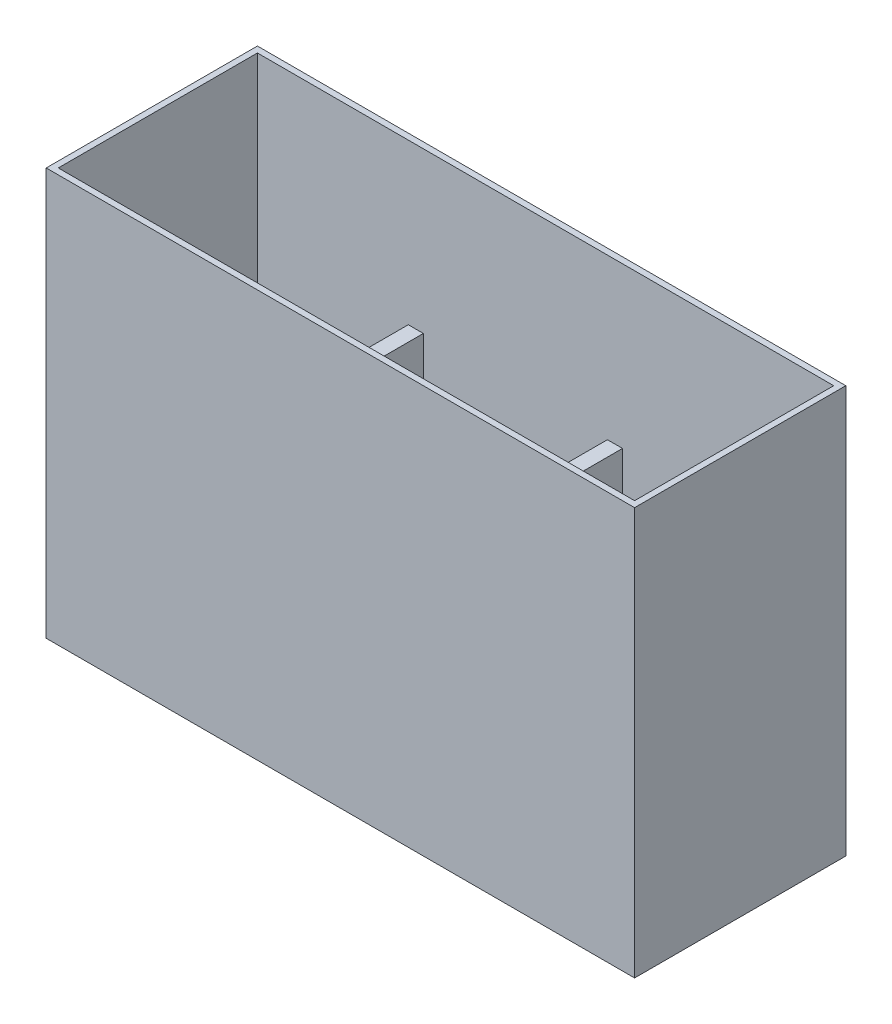
ISO-10303-21;
HEADER;
FILE_DESCRIPTION(('STEP AP214'),'2;1');
FILE_NAME('part.step','',(''),(''),'','','');
FILE_SCHEMA(('AUTOMOTIVE_DESIGN { 1 0 10303 214 1 1 1 1 }'));
ENDSEC;
DATA;
#1=APPLICATION_CONTEXT('core data for automotive mechanical design processes');
#2=APPLICATION_PROTOCOL_DEFINITION('international standard','automotive_design',2000,#1);
#3=PRODUCT_CONTEXT('',#1,'mechanical');
#4=PRODUCT('Part','Part','',(#3));
#5=PRODUCT_RELATED_PRODUCT_CATEGORY('part','',(#4));
#6=PRODUCT_DEFINITION_FORMATION('','',#4);
#7=PRODUCT_DEFINITION_CONTEXT('part definition',#1,'design');
#8=PRODUCT_DEFINITION('design','',#6,#7);
#9=PRODUCT_DEFINITION_SHAPE('','',#8);
#10=(LENGTH_UNIT() NAMED_UNIT(*) SI_UNIT(.MILLI.,.METRE.));
#11=(NAMED_UNIT(*) PLANE_ANGLE_UNIT() SI_UNIT($,.RADIAN.));
#12=(NAMED_UNIT(*) SI_UNIT($,.STERADIAN.) SOLID_ANGLE_UNIT());
#13=UNCERTAINTY_MEASURE_WITH_UNIT(LENGTH_MEASURE(1.E-05),#10,'distance_accuracy_value','');
#14=(GEOMETRIC_REPRESENTATION_CONTEXT(3) GLOBAL_UNCERTAINTY_ASSIGNED_CONTEXT((#13)) GLOBAL_UNIT_ASSIGNED_CONTEXT((#10,
#11,#12)) REPRESENTATION_CONTEXT('',''));
#15=CARTESIAN_POINT('',(0.,0.,0.));
#16=DIRECTION('',(0.,0.,1.));
#17=DIRECTION('',(1.,0.,0.));
#18=AXIS2_PLACEMENT_3D('',#15,#16,#17);
#19=CARTESIAN_POINT('',(0.,2.54,0.));
#20=DIRECTION('',(0.,1.,0.));
#21=DIRECTION('',(0.,0.,1.));
#22=AXIS2_PLACEMENT_3D('',#19,#20,#21);
#23=PLANE('',#22);
#24=DIRECTION('',(-1.,0.,0.));
#25=VECTOR('',#24,1.);
#26=CARTESIAN_POINT('',(0.,2.53999999999999,2.54));
#27=LINE('',#26,#25);
#28=CARTESIAN_POINT('',(149.86,2.54,2.54));
#29=VERTEX_POINT('',#28);
#30=CARTESIAN_POINT('',(72.39,2.54,2.54));
#31=VERTEX_POINT('',#30);
#32=EDGE_CURVE('E216',#29,#31,#27,.T.);
#33=ORIENTED_EDGE('',*,*,#32,.T.);
#34=DIRECTION('',(0.,0.,-1.));
#35=VECTOR('',#34,1.);
#36=CARTESIAN_POINT('',(72.39,2.54,86.36));
#37=LINE('',#36,#35);
#38=CARTESIAN_POINT('',(72.39,2.54,86.36));
#39=VERTEX_POINT('',#38);
#40=EDGE_CURVE('E209',#39,#31,#37,.T.);
#41=ORIENTED_EDGE('',*,*,#40,.F.);
#42=DIRECTION('',(1.,0.,0.));
#43=VECTOR('',#42,1.);
#44=CARTESIAN_POINT('',(0.,2.53999999999999,86.36));
#45=LINE('',#44,#43);
#46=CARTESIAN_POINT('',(149.86,2.54,86.36));
#47=VERTEX_POINT('',#46);
#48=EDGE_CURVE('E511',#39,#47,#45,.T.);
#49=ORIENTED_EDGE('',*,*,#48,.T.);
#50=DIRECTION('',(0.,0.,1.));
#51=VECTOR('',#50,1.);
#52=CARTESIAN_POINT('',(149.86,2.54,67.31));
#53=LINE('',#52,#51);
#54=EDGE_CURVE('E473',#29,#47,#53,.T.);
#55=ORIENTED_EDGE('',*,*,#54,.F.);
#56=EDGE_LOOP('',(#33,#41,#49,#55));
#57=FACE_BOUND('',#56,.T.);
#58=ADVANCED_FACE('F41',(#57),#23,.T.);
#59=CARTESIAN_POINT('',(2.54000000000001,2.54,86.36));
#60=VERTEX_POINT('',#59);
#61=CARTESIAN_POINT('',(66.04,2.54,86.36));
#62=VERTEX_POINT('',#61);
#63=EDGE_CURVE('E207',#60,#62,#45,.T.);
#64=ORIENTED_EDGE('',*,*,#63,.T.);
#65=DIRECTION('',(0.,0.,1.));
#66=VECTOR('',#65,1.);
#67=CARTESIAN_POINT('',(66.04,2.54,2.54));
#68=LINE('',#67,#66);
#69=CARTESIAN_POINT('',(66.04,2.54,2.54));
#70=VERTEX_POINT('',#69);
#71=EDGE_CURVE('E193',#70,#62,#68,.T.);
#72=ORIENTED_EDGE('',*,*,#71,.F.);
#73=CARTESIAN_POINT('',(2.54,2.54,2.54));
#74=VERTEX_POINT('',#73);
#75=EDGE_CURVE('E205',#70,#74,#27,.T.);
#76=ORIENTED_EDGE('',*,*,#75,.T.);
#77=DIRECTION('',(0.,0.,1.));
#78=VECTOR('',#77,1.);
#79=CARTESIAN_POINT('',(2.54,2.53999999999999,0.));
#80=LINE('',#79,#78);
#81=EDGE_CURVE('E499',#74,#60,#80,.T.);
#82=ORIENTED_EDGE('',*,*,#81,.T.);
#83=EDGE_LOOP('',(#64,#72,#76,#82));
#84=FACE_BOUND('',#83,.T.);
#85=ADVANCED_FACE('F203',(#84),#23,.T.);
#86=CARTESIAN_POINT('',(0.,171.45,2.54));
#87=DIRECTION('',(0.,0.,1.));
#88=DIRECTION('',(1.,0.,0.));
#89=AXIS2_PLACEMENT_3D('',#86,#87,#88);
#90=PLANE('',#89);
#91=DIRECTION('',(1.,0.,0.));
#92=VECTOR('',#91,1.);
#93=CARTESIAN_POINT('',(72.39,104.14,2.54));
#94=LINE('',#93,#92);
#95=CARTESIAN_POINT('',(66.04,104.14,2.54));
#96=VERTEX_POINT('',#95);
#97=CARTESIAN_POINT('',(72.39,104.14,2.54));
#98=VERTEX_POINT('',#97);
#99=EDGE_CURVE('E390',#96,#98,#94,.T.);
#100=ORIENTED_EDGE('',*,*,#99,.T.);
#101=DIRECTION('',(0.,-1.,0.));
#102=VECTOR('',#101,1.);
#103=CARTESIAN_POINT('',(72.39,188.200186176334,2.54));
#104=LINE('',#103,#102);
#105=EDGE_CURVE('E405',#98,#31,#104,.T.);
#106=ORIENTED_EDGE('',*,*,#105,.T.);
#107=ORIENTED_EDGE('',*,*,#32,.F.);
#108=DIRECTION('',(0.,-1.,0.));
#109=VECTOR('',#108,1.);
#110=CARTESIAN_POINT('',(149.86,188.200186176334,2.54));
#111=LINE('',#110,#109);
#112=CARTESIAN_POINT('',(149.86,104.14,2.54));
#113=VERTEX_POINT('',#112);
#114=EDGE_CURVE('E424',#113,#29,#111,.T.);
#115=ORIENTED_EDGE('',*,*,#114,.F.);
#116=DIRECTION('',(1.,0.,0.));
#117=VECTOR('',#116,1.);
#118=CARTESIAN_POINT('',(156.21,104.14,2.54));
#119=LINE('',#118,#117);
#120=CARTESIAN_POINT('',(156.21,104.14,2.54));
#121=VERTEX_POINT('',#120);
#122=EDGE_CURVE('E413',#113,#121,#119,.T.);
#123=ORIENTED_EDGE('',*,*,#122,.T.);
#124=DIRECTION('',(0.,-1.,0.));
#125=VECTOR('',#124,1.);
#126=CARTESIAN_POINT('',(156.21,188.200186176334,2.54));
#127=LINE('',#126,#125);
#128=CARTESIAN_POINT('',(156.21,2.54,2.54));
#129=VERTEX_POINT('',#128);
#130=EDGE_CURVE('E428',#121,#129,#127,.T.);
#131=ORIENTED_EDGE('',*,*,#130,.T.);
#132=CARTESIAN_POINT('',(245.11,2.54,2.54));
#133=VERTEX_POINT('',#132);
#134=EDGE_CURVE('E219',#133,#129,#27,.T.);
#135=ORIENTED_EDGE('',*,*,#134,.F.);
#136=DIRECTION('',(0.,-1.,0.));
#137=VECTOR('',#136,1.);
#138=CARTESIAN_POINT('',(245.11,171.45,2.54));
#139=LINE('',#138,#137);
#140=CARTESIAN_POINT('',(245.11,171.45,2.54));
#141=VERTEX_POINT('',#140);
#142=EDGE_CURVE('E508',#141,#133,#139,.T.);
#143=ORIENTED_EDGE('',*,*,#142,.F.);
#144=DIRECTION('',(-1.,0.,0.));
#145=VECTOR('',#144,1.);
#146=CARTESIAN_POINT('',(0.,171.45,2.54));
#147=LINE('',#146,#145);
#148=CARTESIAN_POINT('',(2.54,171.45,2.54));
#149=VERTEX_POINT('',#148);
#150=EDGE_CURVE('E247',#141,#149,#147,.T.);
#151=ORIENTED_EDGE('',*,*,#150,.T.);
#152=DIRECTION('',(0.,-1.,0.));
#153=VECTOR('',#152,1.);
#154=CARTESIAN_POINT('',(2.54,171.45,2.54));
#155=LINE('',#154,#153);
#156=EDGE_CURVE('E213',#149,#74,#155,.T.);
#157=ORIENTED_EDGE('',*,*,#156,.T.);
#158=ORIENTED_EDGE('',*,*,#75,.F.);
#159=DIRECTION('',(0.,-1.,0.));
#160=VECTOR('',#159,1.);
#161=CARTESIAN_POINT('',(66.04,188.200186176334,2.54));
#162=LINE('',#161,#160);
#163=EDGE_CURVE('E190',#96,#70,#162,.T.);
#164=ORIENTED_EDGE('',*,*,#163,.F.);
#165=EDGE_LOOP('',(#100,#106,#107,#115,#123,#131,#135,#143,#151,#157,#158,#164));
#166=FACE_BOUND('',#165,.T.);
#167=ADVANCED_FACE('F211',(#166),#90,.T.);
#168=CARTESIAN_POINT('',(0.,171.45,86.36));
#169=DIRECTION('',(0.,0.,-1.));
#170=DIRECTION('',(-1.,0.,0.));
#171=AXIS2_PLACEMENT_3D('',#168,#169,#170);
#172=PLANE('',#171);
#173=ORIENTED_EDGE('',*,*,#48,.F.);
#174=DIRECTION('',(0.,-1.,0.));
#175=VECTOR('',#174,1.);
#176=CARTESIAN_POINT('',(72.39,188.200186176334,86.36));
#177=LINE('',#176,#175);
#178=CARTESIAN_POINT('',(72.39,104.14,86.36));
#179=VERTEX_POINT('',#178);
#180=EDGE_CURVE('E394',#179,#39,#177,.T.);
#181=ORIENTED_EDGE('',*,*,#180,.F.);
#182=DIRECTION('',(-1.,0.,0.));
#183=VECTOR('',#182,1.);
#184=CARTESIAN_POINT('',(66.04,104.14,86.36));
#185=LINE('',#184,#183);
#186=CARTESIAN_POINT('',(66.04,104.14,86.36));
#187=VERTEX_POINT('',#186);
#188=EDGE_CURVE('E388',#179,#187,#185,.T.);
#189=ORIENTED_EDGE('',*,*,#188,.T.);
#190=DIRECTION('',(0.,-1.,0.));
#191=VECTOR('',#190,1.);
#192=CARTESIAN_POINT('',(66.04,188.200186176334,86.36));
#193=LINE('',#192,#191);
#194=EDGE_CURVE('E57',#187,#62,#193,.T.);
#195=ORIENTED_EDGE('',*,*,#194,.T.);
#196=ORIENTED_EDGE('',*,*,#63,.F.);
#197=DIRECTION('',(0.,-1.,0.));
#198=VECTOR('',#197,1.);
#199=CARTESIAN_POINT('',(2.54000000000001,171.45,86.36));
#200=LINE('',#199,#198);
#201=CARTESIAN_POINT('',(2.54000000000001,171.45,86.36));
#202=VERTEX_POINT('',#201);
#203=EDGE_CURVE('E270',#202,#60,#200,.T.);
#204=ORIENTED_EDGE('',*,*,#203,.F.);
#205=DIRECTION('',(1.,0.,0.));
#206=VECTOR('',#205,1.);
#207=CARTESIAN_POINT('',(0.,171.45,86.36));
#208=LINE('',#207,#206);
#209=CARTESIAN_POINT('',(245.11,171.45,86.36));
#210=VERTEX_POINT('',#209);
#211=EDGE_CURVE('E235',#202,#210,#208,.T.);
#212=ORIENTED_EDGE('',*,*,#211,.T.);
#213=DIRECTION('',(0.,-1.,0.));
#214=VECTOR('',#213,1.);
#215=CARTESIAN_POINT('',(245.11,171.45,86.36));
#216=LINE('',#215,#214);
#217=CARTESIAN_POINT('',(245.11,2.54,86.36));
#218=VERTEX_POINT('',#217);
#219=EDGE_CURVE('E505',#210,#218,#216,.T.);
#220=ORIENTED_EDGE('',*,*,#219,.T.);
#221=CARTESIAN_POINT('',(156.21,2.54,86.36));
#222=VERTEX_POINT('',#221);
#223=EDGE_CURVE('E502',#222,#218,#45,.T.);
#224=ORIENTED_EDGE('',*,*,#223,.F.);
#225=DIRECTION('',(0.,-1.,0.));
#226=VECTOR('',#225,1.);
#227=CARTESIAN_POINT('',(156.21,104.14,86.36));
#228=LINE('',#227,#226);
#229=CARTESIAN_POINT('',(156.21,104.14,86.36));
#230=VERTEX_POINT('',#229);
#231=EDGE_CURVE('E489',#230,#222,#228,.T.);
#232=ORIENTED_EDGE('',*,*,#231,.F.);
#233=DIRECTION('',(1.,0.,0.));
#234=VECTOR('',#233,1.);
#235=CARTESIAN_POINT('',(149.86,104.14,86.36));
#236=LINE('',#235,#234);
#237=CARTESIAN_POINT('',(149.86,104.14,86.36));
#238=VERTEX_POINT('',#237);
#239=EDGE_CURVE('E458',#238,#230,#236,.T.);
#240=ORIENTED_EDGE('',*,*,#239,.F.);
#241=DIRECTION('',(0.,-1.,0.));
#242=VECTOR('',#241,1.);
#243=CARTESIAN_POINT('',(149.86,104.14,86.36));
#244=LINE('',#243,#242);
#245=EDGE_CURVE('E492',#238,#47,#244,.T.);
#246=ORIENTED_EDGE('',*,*,#245,.T.);
#247=EDGE_LOOP('',(#173,#181,#189,#195,#196,#204,#212,#220,#224,#232,#240,#246));
#248=FACE_BOUND('',#247,.T.);
#249=ADVANCED_FACE('F336',(#248),#172,.T.);
#250=ORIENTED_EDGE('',*,*,#134,.T.);
#251=DIRECTION('',(0.,0.,-1.));
#252=VECTOR('',#251,1.);
#253=CARTESIAN_POINT('',(156.21,2.54,67.31));
#254=LINE('',#253,#252);
#255=CARTESIAN_POINT('',(156.21,2.54,67.31));
#256=VERTEX_POINT('',#255);
#257=EDGE_CURVE('E401',#256,#129,#254,.T.);
#258=ORIENTED_EDGE('',*,*,#257,.F.);
#259=DIRECTION('',(-1.,0.,0.));
#260=VECTOR('',#259,1.);
#261=CARTESIAN_POINT('',(245.11,2.54,67.31));
#262=LINE('',#261,#260);
#263=CARTESIAN_POINT('',(245.11,2.54,67.31));
#264=VERTEX_POINT('',#263);
#265=EDGE_CURVE('E440',#264,#256,#262,.T.);
#266=ORIENTED_EDGE('',*,*,#265,.F.);
#267=DIRECTION('',(0.,0.,-1.));
#268=VECTOR('',#267,1.);
#269=CARTESIAN_POINT('',(245.11,2.53999999999999,0.));
#270=LINE('',#269,#268);
#271=EDGE_CURVE('E224',#264,#133,#270,.T.);
#272=ORIENTED_EDGE('',*,*,#271,.T.);
#273=EDGE_LOOP('',(#250,#258,#266,#272));
#274=FACE_BOUND('',#273,.T.);
#275=ADVANCED_FACE('F321',(#274),#23,.T.);
#276=CARTESIAN_POINT('',(245.11,104.14,67.31));
#277=DIRECTION('',(0.,0.,1.));
#278=DIRECTION('',(1.,0.,0.));
#279=AXIS2_PLACEMENT_3D('',#276,#277,#278);
#280=PLANE('',#279);
#281=DIRECTION('',(0.,-1.,0.));
#282=VECTOR('',#281,1.);
#283=CARTESIAN_POINT('',(156.21,188.200186176334,67.31));
#284=LINE('',#283,#282);
#285=CARTESIAN_POINT('',(156.21,104.14,67.31));
#286=VERTEX_POINT('',#285);
#287=EDGE_CURVE('E418',#286,#256,#284,.T.);
#288=ORIENTED_EDGE('',*,*,#287,.F.);
#289=DIRECTION('',(-1.,0.,0.));
#290=VECTOR('',#289,1.);
#291=CARTESIAN_POINT('',(245.11,104.14,67.31));
#292=LINE('',#291,#290);
#293=CARTESIAN_POINT('',(172.085,104.14,67.31));
#294=VERTEX_POINT('',#293);
#295=EDGE_CURVE('E449',#294,#286,#292,.T.);
#296=ORIENTED_EDGE('',*,*,#295,.F.);
#297=CARTESIAN_POINT('',(197.485,104.14,67.31));
#298=DIRECTION('',(0.,0.,-1.));
#299=DIRECTION('',(-1.,0.,0.));
#300=AXIS2_PLACEMENT_3D('',#297,#298,#299);
#301=CIRCLE('',#300,25.4);
#302=CARTESIAN_POINT('',(222.885,104.14,67.31));
#303=VERTEX_POINT('',#302);
#304=EDGE_CURVE('E436',#303,#294,#301,.T.);
#305=ORIENTED_EDGE('',*,*,#304,.F.);
#306=CARTESIAN_POINT('',(245.11,104.14,67.31));
#307=VERTEX_POINT('',#306);
#308=EDGE_CURVE('E451',#307,#303,#292,.T.);
#309=ORIENTED_EDGE('',*,*,#308,.F.);
#310=DIRECTION('',(0.,-1.,0.));
#311=VECTOR('',#310,1.);
#312=CARTESIAN_POINT('',(245.11,104.14,67.31));
#313=LINE('',#312,#311);
#314=EDGE_CURVE('E496',#307,#264,#313,.T.);
#315=ORIENTED_EDGE('',*,*,#314,.T.);
#316=ORIENTED_EDGE('',*,*,#265,.T.);
#317=EDGE_LOOP('',(#288,#296,#305,#309,#315,#316));
#318=FACE_BOUND('',#317,.T.);
#319=ADVANCED_FACE('F335',(#318),#280,.F.);
#320=CARTESIAN_POINT('',(0.,104.14,0.));
#321=DIRECTION('',(0.,-1.,0.));
#322=DIRECTION('',(0.,0.,-1.));
#323=AXIS2_PLACEMENT_3D('',#320,#321,#322);
#324=PLANE('',#323);
#325=DIRECTION('',(1.,0.,0.));
#326=VECTOR('',#325,1.);
#327=CARTESIAN_POINT('',(245.11,104.14,73.66));
#328=LINE('',#327,#326);
#329=CARTESIAN_POINT('',(156.21,104.14,73.66));
#330=VERTEX_POINT('',#329);
#331=CARTESIAN_POINT('',(172.085,104.14,73.66));
#332=VERTEX_POINT('',#331);
#333=EDGE_CURVE('E465',#330,#332,#328,.T.);
#334=ORIENTED_EDGE('',*,*,#333,.T.);
#335=DIRECTION('',(0.,0.,-1.));
#336=VECTOR('',#335,1.);
#337=CARTESIAN_POINT('',(172.085,104.14,88.901));
#338=LINE('',#337,#336);
#339=EDGE_CURVE('E421',#294,#332,#338,.F.);
#340=ORIENTED_EDGE('',*,*,#339,.F.);
#341=ORIENTED_EDGE('',*,*,#295,.T.);
#342=DIRECTION('',(0.,0.,1.));
#343=VECTOR('',#342,1.);
#344=CARTESIAN_POINT('',(156.21,104.14,67.31));
#345=LINE('',#344,#343);
#346=EDGE_CURVE('E417',#121,#286,#345,.T.);
#347=ORIENTED_EDGE('',*,*,#346,.F.);
#348=ORIENTED_EDGE('',*,*,#122,.F.);
#349=DIRECTION('',(0.,0.,1.));
#350=VECTOR('',#349,1.);
#351=CARTESIAN_POINT('',(149.86,104.14,67.31));
#352=LINE('',#351,#350);
#353=EDGE_CURVE('E455',#113,#238,#352,.T.);
#354=ORIENTED_EDGE('',*,*,#353,.T.);
#355=ORIENTED_EDGE('',*,*,#239,.T.);
#356=DIRECTION('',(0.,0.,-1.));
#357=VECTOR('',#356,1.);
#358=CARTESIAN_POINT('',(156.21,104.14,73.66));
#359=LINE('',#358,#357);
#360=EDGE_CURVE('E461',#230,#330,#359,.T.);
#361=ORIENTED_EDGE('',*,*,#360,.T.);
#362=EDGE_LOOP('',(#334,#340,#341,#347,#348,#354,#355,#361));
#363=FACE_BOUND('',#362,.T.);
#364=ADVANCED_FACE('F330',(#363),#324,.F.);
#365=CARTESIAN_POINT('',(245.11,171.45,0.));
#366=DIRECTION('',(-1.,0.,0.));
#367=DIRECTION('',(0.,0.,1.));
#368=AXIS2_PLACEMENT_3D('',#365,#366,#367);
#369=PLANE('',#368);
#370=ORIENTED_EDGE('',*,*,#271,.F.);
#371=ORIENTED_EDGE('',*,*,#314,.F.);
#372=DIRECTION('',(0.,0.,-1.));
#373=VECTOR('',#372,1.);
#374=CARTESIAN_POINT('',(245.11,104.14,67.31));
#375=LINE('',#374,#373);
#376=CARTESIAN_POINT('',(245.11,104.14,73.66));
#377=VERTEX_POINT('',#376);
#378=EDGE_CURVE('E445',#377,#307,#375,.T.);
#379=ORIENTED_EDGE('',*,*,#378,.F.);
#380=DIRECTION('',(0.,-1.,0.));
#381=VECTOR('',#380,1.);
#382=CARTESIAN_POINT('',(245.11,104.14,73.66));
#383=LINE('',#382,#381);
#384=CARTESIAN_POINT('',(245.11,2.54,73.66));
#385=VERTEX_POINT('',#384);
#386=EDGE_CURVE('E469',#377,#385,#383,.T.);
#387=ORIENTED_EDGE('',*,*,#386,.T.);
#388=EDGE_CURVE('E217',#218,#385,#270,.T.);
#389=ORIENTED_EDGE('',*,*,#388,.F.);
#390=ORIENTED_EDGE('',*,*,#219,.F.);
#391=DIRECTION('',(0.,0.,-1.));
#392=VECTOR('',#391,1.);
#393=CARTESIAN_POINT('',(245.11,171.45,0.));
#394=LINE('',#393,#392);
#395=EDGE_CURVE('E241',#210,#141,#394,.T.);
#396=ORIENTED_EDGE('',*,*,#395,.T.);
#397=ORIENTED_EDGE('',*,*,#142,.T.);
#398=EDGE_LOOP('',(#370,#371,#379,#387,#389,#390,#396,#397));
#399=FACE_BOUND('',#398,.T.);
#400=ADVANCED_FACE('F325',(#399),#369,.T.);
#401=DIRECTION('',(1.,0.,0.));
#402=VECTOR('',#401,1.);
#403=CARTESIAN_POINT('',(245.11,2.54,73.66));
#404=LINE('',#403,#402);
#405=CARTESIAN_POINT('',(156.21,2.54,73.66));
#406=VERTEX_POINT('',#405);
#407=EDGE_CURVE('E450',#406,#385,#404,.T.);
#408=ORIENTED_EDGE('',*,*,#407,.F.);
#409=DIRECTION('',(0.,0.,-1.));
#410=VECTOR('',#409,1.);
#411=CARTESIAN_POINT('',(156.21,2.54,73.66));
#412=LINE('',#411,#410);
#413=EDGE_CURVE('E477',#222,#406,#412,.T.);
#414=ORIENTED_EDGE('',*,*,#413,.F.);
#415=ORIENTED_EDGE('',*,*,#223,.T.);
#416=ORIENTED_EDGE('',*,*,#388,.T.);
#417=EDGE_LOOP('',(#408,#414,#415,#416));
#418=FACE_BOUND('',#417,.T.);
#419=ADVANCED_FACE('F313',(#418),#23,.T.);
#420=CARTESIAN_POINT('',(0.,171.45,0.));
#421=DIRECTION('',(1.,0.,0.));
#422=DIRECTION('',(0.,0.,-1.));
#423=AXIS2_PLACEMENT_3D('',#420,#421,#422);
#424=PLANE('',#423);
#425=DIRECTION('',(0.,0.,1.));
#426=VECTOR('',#425,1.);
#427=CARTESIAN_POINT('',(0.,0.,0.));
#428=LINE('',#427,#426);
#429=CARTESIAN_POINT('',(0.,0.,0.));
#430=VERTEX_POINT('',#429);
#431=CARTESIAN_POINT('',(0.,0.,88.9));
#432=VERTEX_POINT('',#431);
#433=EDGE_CURVE('E265',#430,#432,#428,.T.);
#434=ORIENTED_EDGE('',*,*,#433,.T.);
#435=DIRECTION('',(0.,-1.,0.));
#436=VECTOR('',#435,1.);
#437=CARTESIAN_POINT('',(0.,171.45,88.9));
#438=LINE('',#437,#436);
#439=CARTESIAN_POINT('',(0.,171.45,88.9));
#440=VERTEX_POINT('',#439);
#441=EDGE_CURVE('E11',#440,#432,#438,.T.);
#442=ORIENTED_EDGE('',*,*,#441,.F.);
#443=DIRECTION('',(0.,0.,1.));
#444=VECTOR('',#443,1.);
#445=CARTESIAN_POINT('',(0.,171.45,0.));
#446=LINE('',#445,#444);
#447=CARTESIAN_POINT('',(0.,171.45,0.));
#448=VERTEX_POINT('',#447);
#449=EDGE_CURVE('E250',#448,#440,#446,.T.);
#450=ORIENTED_EDGE('',*,*,#449,.F.);
#451=DIRECTION('',(0.,-1.,0.));
#452=VECTOR('',#451,1.);
#453=CARTESIAN_POINT('',(0.,171.45,0.));
#454=LINE('',#453,#452);
#455=EDGE_CURVE('E264',#448,#430,#454,.T.);
#456=ORIENTED_EDGE('',*,*,#455,.T.);
#457=EDGE_LOOP('',(#434,#442,#450,#456));
#458=FACE_BOUND('',#457,.T.);
#459=ADVANCED_FACE('F43',(#458),#424,.F.);
#460=CARTESIAN_POINT('',(0.,171.45,88.9));
#461=DIRECTION('',(0.,0.,-1.));
#462=DIRECTION('',(-1.,0.,0.));
#463=AXIS2_PLACEMENT_3D('',#460,#461,#462);
#464=PLANE('',#463);
#465=DIRECTION('',(1.,0.,0.));
#466=VECTOR('',#465,1.);
#467=CARTESIAN_POINT('',(0.,0.,88.9));
#468=LINE('',#467,#466);
#469=CARTESIAN_POINT('',(247.65,0.,88.9));
#470=VERTEX_POINT('',#469);
#471=EDGE_CURVE('E269',#432,#470,#468,.T.);
#472=ORIENTED_EDGE('',*,*,#471,.T.);
#473=DIRECTION('',(0.,-1.,0.));
#474=VECTOR('',#473,1.);
#475=CARTESIAN_POINT('',(247.65,171.45,88.9));
#476=LINE('',#475,#474);
#477=CARTESIAN_POINT('',(247.65,171.45,88.9));
#478=VERTEX_POINT('',#477);
#479=EDGE_CURVE('E50',#478,#470,#476,.T.);
#480=ORIENTED_EDGE('',*,*,#479,.F.);
#481=DIRECTION('',(1.,0.,0.));
#482=VECTOR('',#481,1.);
#483=CARTESIAN_POINT('',(0.,171.45,88.9));
#484=LINE('',#483,#482);
#485=EDGE_CURVE('E254',#440,#478,#484,.T.);
#486=ORIENTED_EDGE('',*,*,#485,.F.);
#487=ORIENTED_EDGE('',*,*,#441,.T.);
#488=EDGE_LOOP('',(#472,#480,#486,#487));
#489=FACE_BOUND('',#488,.T.);
#490=ADVANCED_FACE('F306',(#489),#464,.F.);
#491=CARTESIAN_POINT('',(247.65,171.45,0.));
#492=DIRECTION('',(-1.,0.,0.));
#493=DIRECTION('',(0.,0.,1.));
#494=AXIS2_PLACEMENT_3D('',#491,#492,#493);
#495=PLANE('',#494);
#496=DIRECTION('',(0.,0.,-1.));
#497=VECTOR('',#496,1.);
#498=CARTESIAN_POINT('',(247.65,0.,0.));
#499=LINE('',#498,#497);
#500=CARTESIAN_POINT('',(247.65,0.,0.));
#501=VERTEX_POINT('',#500);
#502=EDGE_CURVE('E273',#470,#501,#499,.T.);
#503=ORIENTED_EDGE('',*,*,#502,.T.);
#504=DIRECTION('',(0.,-1.,0.));
#505=VECTOR('',#504,1.);
#506=CARTESIAN_POINT('',(247.65,171.45,0.));
#507=LINE('',#506,#505);
#508=CARTESIAN_POINT('',(247.65,171.45,0.));
#509=VERTEX_POINT('',#508);
#510=EDGE_CURVE('E281',#509,#501,#507,.T.);
#511=ORIENTED_EDGE('',*,*,#510,.F.);
#512=DIRECTION('',(0.,0.,-1.));
#513=VECTOR('',#512,1.);
#514=CARTESIAN_POINT('',(247.65,171.45,0.));
#515=LINE('',#514,#513);
#516=EDGE_CURVE('E258',#478,#509,#515,.T.);
#517=ORIENTED_EDGE('',*,*,#516,.F.);
#518=ORIENTED_EDGE('',*,*,#479,.T.);
#519=EDGE_LOOP('',(#503,#511,#517,#518));
#520=FACE_BOUND('',#519,.T.);
#521=ADVANCED_FACE('F290',(#520),#495,.F.);
#522=CARTESIAN_POINT('',(0.,171.45,0.));
#523=DIRECTION('',(0.,0.,1.));
#524=DIRECTION('',(1.,0.,0.));
#525=AXIS2_PLACEMENT_3D('',#522,#523,#524);
#526=PLANE('',#525);
#527=DIRECTION('',(-1.,0.,0.));
#528=VECTOR('',#527,1.);
#529=CARTESIAN_POINT('',(0.,0.,0.));
#530=LINE('',#529,#528);
#531=EDGE_CURVE('E255',#501,#430,#530,.T.);
#532=ORIENTED_EDGE('',*,*,#531,.T.);
#533=ORIENTED_EDGE('',*,*,#455,.F.);
#534=DIRECTION('',(-1.,0.,0.));
#535=VECTOR('',#534,1.);
#536=CARTESIAN_POINT('',(0.,171.45,0.));
#537=LINE('',#536,#535);
#538=EDGE_CURVE('E261',#509,#448,#537,.T.);
#539=ORIENTED_EDGE('',*,*,#538,.F.);
#540=ORIENTED_EDGE('',*,*,#510,.T.);
#541=EDGE_LOOP('',(#532,#533,#539,#540));
#542=FACE_BOUND('',#541,.T.);
#543=ADVANCED_FACE('F299',(#542),#526,.F.);
#544=CARTESIAN_POINT('',(0.,171.45,0.));
#545=DIRECTION('',(0.,1.,0.));
#546=DIRECTION('',(0.,0.,1.));
#547=AXIS2_PLACEMENT_3D('',#544,#545,#546);
#548=PLANE('',#547);
#549=DIRECTION('',(0.,0.,1.));
#550=VECTOR('',#549,1.);
#551=CARTESIAN_POINT('',(2.54,171.45,0.));
#552=LINE('',#551,#550);
#553=EDGE_CURVE('E230',#149,#202,#552,.T.);
#554=ORIENTED_EDGE('',*,*,#553,.F.);
#555=ORIENTED_EDGE('',*,*,#150,.F.);
#556=ORIENTED_EDGE('',*,*,#395,.F.);
#557=ORIENTED_EDGE('',*,*,#211,.F.);
#558=EDGE_LOOP('',(#554,#555,#556,#557));
#559=FACE_BOUND('',#558,.T.);
#560=ORIENTED_EDGE('',*,*,#449,.T.);
#561=ORIENTED_EDGE('',*,*,#485,.T.);
#562=ORIENTED_EDGE('',*,*,#516,.T.);
#563=ORIENTED_EDGE('',*,*,#538,.T.);
#564=EDGE_LOOP('',(#560,#561,#562,#563));
#565=FACE_BOUND('',#564,.T.);
#566=ADVANCED_FACE('F305',(#559,#565),#548,.T.);
#567=CARTESIAN_POINT('',(0.,0.,0.));
#568=DIRECTION('',(0.,1.,0.));
#569=DIRECTION('',(0.,0.,1.));
#570=AXIS2_PLACEMENT_3D('',#567,#568,#569);
#571=PLANE('',#570);
#572=ORIENTED_EDGE('',*,*,#433,.F.);
#573=ORIENTED_EDGE('',*,*,#531,.F.);
#574=ORIENTED_EDGE('',*,*,#502,.F.);
#575=ORIENTED_EDGE('',*,*,#471,.F.);
#576=EDGE_LOOP('',(#572,#573,#574,#575));
#577=FACE_BOUND('',#576,.T.);
#578=ADVANCED_FACE('F296',(#577),#571,.F.);
#579=CARTESIAN_POINT('',(2.54,171.45,0.));
#580=DIRECTION('',(1.,0.,0.));
#581=DIRECTION('',(0.,0.,-1.));
#582=AXIS2_PLACEMENT_3D('',#579,#580,#581);
#583=PLANE('',#582);
#584=ORIENTED_EDGE('',*,*,#81,.F.);
#585=ORIENTED_EDGE('',*,*,#156,.F.);
#586=ORIENTED_EDGE('',*,*,#553,.T.);
#587=ORIENTED_EDGE('',*,*,#203,.T.);
#588=EDGE_LOOP('',(#584,#585,#586,#587));
#589=FACE_BOUND('',#588,.T.);
#590=ADVANCED_FACE('F350',(#589),#583,.T.);
#591=CARTESIAN_POINT('',(149.86,104.14,67.31));
#592=DIRECTION('',(1.,0.,0.));
#593=DIRECTION('',(0.,0.,-1.));
#594=AXIS2_PLACEMENT_3D('',#591,#592,#593);
#595=PLANE('',#594);
#596=ORIENTED_EDGE('',*,*,#54,.T.);
#597=ORIENTED_EDGE('',*,*,#245,.F.);
#598=ORIENTED_EDGE('',*,*,#353,.F.);
#599=ORIENTED_EDGE('',*,*,#114,.T.);
#600=EDGE_LOOP('',(#596,#597,#598,#599));
#601=FACE_BOUND('',#600,.T.);
#602=ADVANCED_FACE('F352',(#601),#595,.F.);
#603=CARTESIAN_POINT('',(156.21,104.14,73.66));
#604=DIRECTION('',(-1.,0.,0.));
#605=DIRECTION('',(0.,0.,1.));
#606=AXIS2_PLACEMENT_3D('',#603,#604,#605);
#607=PLANE('',#606);
#608=ORIENTED_EDGE('',*,*,#413,.T.);
#609=DIRECTION('',(0.,-1.,0.));
#610=VECTOR('',#609,1.);
#611=CARTESIAN_POINT('',(156.21,104.14,73.66));
#612=LINE('',#611,#610);
#613=EDGE_CURVE('E486',#330,#406,#612,.T.);
#614=ORIENTED_EDGE('',*,*,#613,.F.);
#615=ORIENTED_EDGE('',*,*,#360,.F.);
#616=ORIENTED_EDGE('',*,*,#231,.T.);
#617=EDGE_LOOP('',(#608,#614,#615,#616));
#618=FACE_BOUND('',#617,.T.);
#619=ADVANCED_FACE('F356',(#618),#607,.F.);
#620=CARTESIAN_POINT('',(245.11,104.14,73.66));
#621=DIRECTION('',(0.,0.,-1.));
#622=DIRECTION('',(-1.,0.,0.));
#623=AXIS2_PLACEMENT_3D('',#620,#621,#622);
#624=PLANE('',#623);
#625=CARTESIAN_POINT('',(222.885,104.14,73.66));
#626=VERTEX_POINT('',#625);
#627=EDGE_CURVE('E464',#626,#377,#328,.T.);
#628=ORIENTED_EDGE('',*,*,#627,.F.);
#629=CARTESIAN_POINT('',(197.485,104.14,73.66));
#630=DIRECTION('',(0.,0.,-1.));
#631=DIRECTION('',(-1.,0.,0.));
#632=AXIS2_PLACEMENT_3D('',#629,#630,#631);
#633=CIRCLE('',#632,25.4);
#634=EDGE_CURVE('E65',#332,#626,#633,.F.);
#635=ORIENTED_EDGE('',*,*,#634,.F.);
#636=ORIENTED_EDGE('',*,*,#333,.F.);
#637=ORIENTED_EDGE('',*,*,#613,.T.);
#638=ORIENTED_EDGE('',*,*,#407,.T.);
#639=ORIENTED_EDGE('',*,*,#386,.F.);
#640=EDGE_LOOP('',(#628,#635,#636,#637,#638,#639));
#641=FACE_BOUND('',#640,.T.);
#642=ADVANCED_FACE('F360',(#641),#624,.F.);
#643=ORIENTED_EDGE('',*,*,#308,.T.);
#644=DIRECTION('',(0.,0.,-1.));
#645=VECTOR('',#644,1.);
#646=CARTESIAN_POINT('',(222.885,104.14,88.901));
#647=LINE('',#646,#645);
#648=EDGE_CURVE('E437',#626,#303,#647,.T.);
#649=ORIENTED_EDGE('',*,*,#648,.F.);
#650=ORIENTED_EDGE('',*,*,#627,.T.);
#651=ORIENTED_EDGE('',*,*,#378,.T.);
#652=EDGE_LOOP('',(#643,#649,#650,#651));
#653=FACE_BOUND('',#652,.T.);
#654=ADVANCED_FACE('F364',(#653),#324,.F.);
#655=CARTESIAN_POINT('',(197.485,104.14,88.901));
#656=DIRECTION('',(0.,0.,-1.));
#657=DIRECTION('',(-1.,0.,0.));
#658=AXIS2_PLACEMENT_3D('',#655,#656,#657);
#659=CYLINDRICAL_SURFACE('',#658,25.4);
#660=ORIENTED_EDGE('',*,*,#339,.T.);
#661=ORIENTED_EDGE('',*,*,#634,.T.);
#662=ORIENTED_EDGE('',*,*,#648,.T.);
#663=ORIENTED_EDGE('',*,*,#304,.T.);
#664=EDGE_LOOP('',(#660,#661,#662,#663));
#665=FACE_BOUND('',#664,.T.);
#666=ADVANCED_FACE('F368',(#665),#659,.F.);
#667=CARTESIAN_POINT('',(156.21,188.200186176334,67.31));
#668=DIRECTION('',(-1.,0.,0.));
#669=DIRECTION('',(0.,0.,1.));
#670=AXIS2_PLACEMENT_3D('',#667,#668,#669);
#671=PLANE('',#670);
#672=ORIENTED_EDGE('',*,*,#130,.F.);
#673=ORIENTED_EDGE('',*,*,#346,.T.);
#674=ORIENTED_EDGE('',*,*,#287,.T.);
#675=ORIENTED_EDGE('',*,*,#257,.T.);
#676=EDGE_LOOP('',(#672,#673,#674,#675));
#677=FACE_BOUND('',#676,.T.);
#678=ADVANCED_FACE('F372',(#677),#671,.F.);
#679=CARTESIAN_POINT('',(72.39,188.200186176334,86.36));
#680=DIRECTION('',(-1.,0.,0.));
#681=DIRECTION('',(0.,0.,1.));
#682=AXIS2_PLACEMENT_3D('',#679,#680,#681);
#683=PLANE('',#682);
#684=ORIENTED_EDGE('',*,*,#105,.F.);
#685=DIRECTION('',(0.,0.,1.));
#686=VECTOR('',#685,1.);
#687=CARTESIAN_POINT('',(72.39,104.14,86.36));
#688=LINE('',#687,#686);
#689=EDGE_CURVE('E199',#98,#179,#688,.T.);
#690=ORIENTED_EDGE('',*,*,#689,.T.);
#691=ORIENTED_EDGE('',*,*,#180,.T.);
#692=ORIENTED_EDGE('',*,*,#40,.T.);
#693=EDGE_LOOP('',(#684,#690,#691,#692));
#694=FACE_BOUND('',#693,.T.);
#695=ADVANCED_FACE('F375',(#694),#683,.F.);
#696=CARTESIAN_POINT('',(66.04,188.200186176334,2.54));
#697=DIRECTION('',(1.,0.,0.));
#698=DIRECTION('',(0.,0.,-1.));
#699=AXIS2_PLACEMENT_3D('',#696,#697,#698);
#700=PLANE('',#699);
#701=ORIENTED_EDGE('',*,*,#194,.F.);
#702=DIRECTION('',(0.,0.,-1.));
#703=VECTOR('',#702,1.);
#704=CARTESIAN_POINT('',(66.04,104.14,2.54));
#705=LINE('',#704,#703);
#706=EDGE_CURVE('E194',#187,#96,#705,.T.);
#707=ORIENTED_EDGE('',*,*,#706,.T.);
#708=ORIENTED_EDGE('',*,*,#163,.T.);
#709=ORIENTED_EDGE('',*,*,#71,.T.);
#710=EDGE_LOOP('',(#701,#707,#708,#709));
#711=FACE_BOUND('',#710,.T.);
#712=ADVANCED_FACE('F192',(#711),#700,.F.);
#713=CARTESIAN_POINT('',(0.,104.14,0.));
#714=DIRECTION('',(0.,-1.,0.));
#715=DIRECTION('',(0.,0.,-1.));
#716=AXIS2_PLACEMENT_3D('',#713,#714,#715);
#717=PLANE('',#716);
#718=ORIENTED_EDGE('',*,*,#706,.F.);
#719=ORIENTED_EDGE('',*,*,#188,.F.);
#720=ORIENTED_EDGE('',*,*,#689,.F.);
#721=ORIENTED_EDGE('',*,*,#99,.F.);
#722=EDGE_LOOP('',(#718,#719,#720,#721));
#723=FACE_BOUND('',#722,.T.);
#724=ADVANCED_FACE('F379',(#723),#717,.F.);
#725=CLOSED_SHELL('',(#58,#85,#167,#249,#275,#319,#364,#400,#419,#459,#490,#521,#543,#566,#578,
#590,#602,#619,#642,#654,#666,#678,#695,#712,#724));
#726=MANIFOLD_SOLID_BREP('B2',#725);
#727=ADVANCED_BREP_SHAPE_REPRESENTATION('',(#18,#726),#14);
#728=SHAPE_DEFINITION_REPRESENTATION(#9,#727);
ENDSEC;
END-ISO-10303-21;
